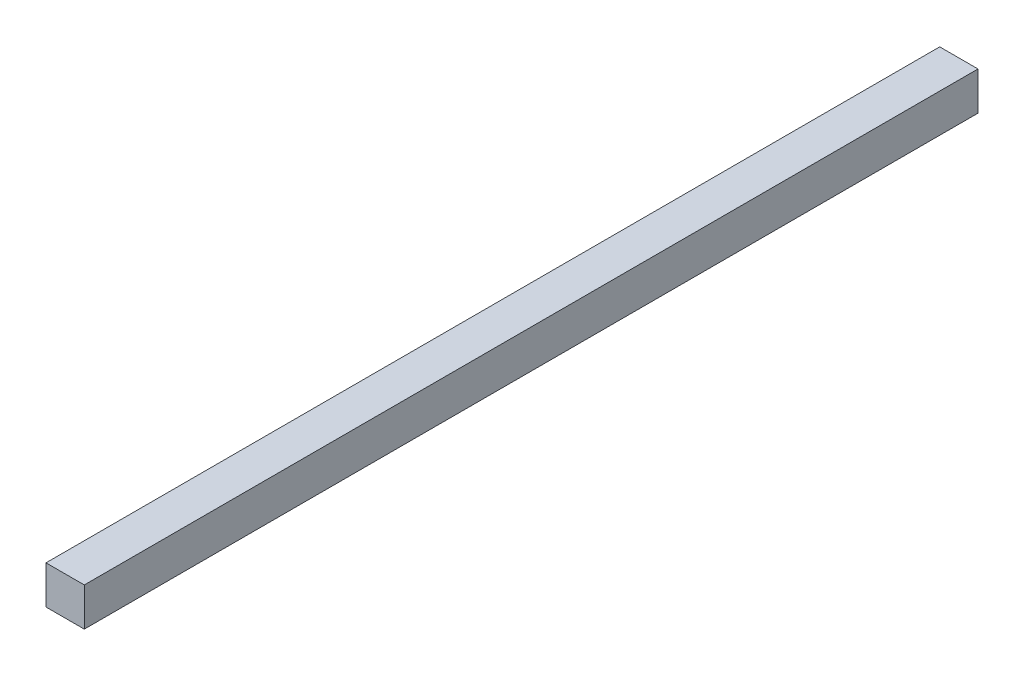
ISO-10303-21;
HEADER;
FILE_DESCRIPTION(('STEP AP214'),'2;1');
FILE_NAME('part.step','',(''),(''),'','','');
FILE_SCHEMA(('AUTOMOTIVE_DESIGN { 1 0 10303 214 1 1 1 1 }'));
ENDSEC;
DATA;
#1=APPLICATION_CONTEXT('core data for automotive mechanical design processes');
#2=APPLICATION_PROTOCOL_DEFINITION('international standard','automotive_design',2000,#1);
#3=PRODUCT_CONTEXT('',#1,'mechanical');
#4=PRODUCT('Part','Part','',(#3));
#5=PRODUCT_RELATED_PRODUCT_CATEGORY('part','',(#4));
#6=PRODUCT_DEFINITION_FORMATION('','',#4);
#7=PRODUCT_DEFINITION_CONTEXT('part definition',#1,'design');
#8=PRODUCT_DEFINITION('design','',#6,#7);
#9=PRODUCT_DEFINITION_SHAPE('','',#8);
#10=(LENGTH_UNIT() NAMED_UNIT(*) SI_UNIT(.MILLI.,.METRE.));
#11=(NAMED_UNIT(*) PLANE_ANGLE_UNIT() SI_UNIT($,.RADIAN.));
#12=(NAMED_UNIT(*) SI_UNIT($,.STERADIAN.) SOLID_ANGLE_UNIT());
#13=UNCERTAINTY_MEASURE_WITH_UNIT(LENGTH_MEASURE(1.E-05),#10,'distance_accuracy_value','');
#14=(GEOMETRIC_REPRESENTATION_CONTEXT(3) GLOBAL_UNCERTAINTY_ASSIGNED_CONTEXT((#13)) GLOBAL_UNIT_ASSIGNED_CONTEXT((#10,
#11,#12)) REPRESENTATION_CONTEXT('',''));
#15=CARTESIAN_POINT('',(0.,0.,0.));
#16=DIRECTION('',(0.,0.,1.));
#17=DIRECTION('',(1.,0.,0.));
#18=AXIS2_PLACEMENT_3D('',#15,#16,#17);
#19=CARTESIAN_POINT('',(15.,-15.,700.));
#20=DIRECTION('',(-1.,0.,0.));
#21=DIRECTION('',(0.,0.,1.));
#22=AXIS2_PLACEMENT_3D('',#19,#20,#21);
#23=PLANE('',#22);
#24=DIRECTION('',(0.,1.,0.));
#25=VECTOR('',#24,1.);
#26=CARTESIAN_POINT('',(15.,-15.,0.));
#27=LINE('',#26,#25);
#28=CARTESIAN_POINT('',(15.,-15.,0.));
#29=VERTEX_POINT('',#28);
#30=CARTESIAN_POINT('',(15.,15.,0.));
#31=VERTEX_POINT('',#30);
#32=EDGE_CURVE('E107',#29,#31,#27,.T.);
#33=ORIENTED_EDGE('',*,*,#32,.T.);
#34=DIRECTION('',(0.,0.,-1.));
#35=VECTOR('',#34,1.);
#36=CARTESIAN_POINT('',(15.,15.,700.));
#37=LINE('',#36,#35);
#38=CARTESIAN_POINT('',(15.,15.,700.));
#39=VERTEX_POINT('',#38);
#40=EDGE_CURVE('E11',#39,#31,#37,.T.);
#41=ORIENTED_EDGE('',*,*,#40,.F.);
#42=DIRECTION('',(0.,1.,0.));
#43=VECTOR('',#42,1.);
#44=CARTESIAN_POINT('',(15.,-15.,700.));
#45=LINE('',#44,#43);
#46=CARTESIAN_POINT('',(15.,-15.,700.));
#47=VERTEX_POINT('',#46);
#48=EDGE_CURVE('E91',#47,#39,#45,.T.);
#49=ORIENTED_EDGE('',*,*,#48,.F.);
#50=DIRECTION('',(0.,0.,-1.));
#51=VECTOR('',#50,1.);
#52=CARTESIAN_POINT('',(15.,-15.,700.));
#53=LINE('',#52,#51);
#54=EDGE_CURVE('E103',#47,#29,#53,.T.);
#55=ORIENTED_EDGE('',*,*,#54,.T.);
#56=EDGE_LOOP('',(#33,#41,#49,#55));
#57=FACE_BOUND('',#56,.T.);
#58=ADVANCED_FACE('F39',(#57),#23,.F.);
#59=CARTESIAN_POINT('',(-15.,15.,700.));
#60=DIRECTION('',(0.,-1.,0.));
#61=DIRECTION('',(0.,0.,-1.));
#62=AXIS2_PLACEMENT_3D('',#59,#60,#61);
#63=PLANE('',#62);
#64=DIRECTION('',(-1.,0.,0.));
#65=VECTOR('',#64,1.);
#66=CARTESIAN_POINT('',(-15.,15.,0.));
#67=LINE('',#66,#65);
#68=CARTESIAN_POINT('',(-15.,15.,0.));
#69=VERTEX_POINT('',#68);
#70=EDGE_CURVE('E96',#31,#69,#67,.T.);
#71=ORIENTED_EDGE('',*,*,#70,.T.);
#72=DIRECTION('',(0.,0.,-1.));
#73=VECTOR('',#72,1.);
#74=CARTESIAN_POINT('',(-15.,15.,700.));
#75=LINE('',#74,#73);
#76=CARTESIAN_POINT('',(-15.,15.,700.));
#77=VERTEX_POINT('',#76);
#78=EDGE_CURVE('E48',#77,#69,#75,.T.);
#79=ORIENTED_EDGE('',*,*,#78,.F.);
#80=DIRECTION('',(-1.,0.,0.));
#81=VECTOR('',#80,1.);
#82=CARTESIAN_POINT('',(-15.,15.,700.));
#83=LINE('',#82,#81);
#84=EDGE_CURVE('E86',#39,#77,#83,.T.);
#85=ORIENTED_EDGE('',*,*,#84,.F.);
#86=ORIENTED_EDGE('',*,*,#40,.T.);
#87=EDGE_LOOP('',(#71,#79,#85,#86));
#88=FACE_BOUND('',#87,.T.);
#89=ADVANCED_FACE('F95',(#88),#63,.F.);
#90=CARTESIAN_POINT('',(-15.,-15.,700.));
#91=DIRECTION('',(1.,0.,0.));
#92=DIRECTION('',(0.,0.,-1.));
#93=AXIS2_PLACEMENT_3D('',#90,#91,#92);
#94=PLANE('',#93);
#95=DIRECTION('',(0.,-1.,0.));
#96=VECTOR('',#95,1.);
#97=CARTESIAN_POINT('',(-15.,-15.,0.));
#98=LINE('',#97,#96);
#99=CARTESIAN_POINT('',(-15.,-15.,0.));
#100=VERTEX_POINT('',#99);
#101=EDGE_CURVE('E73',#69,#100,#98,.T.);
#102=ORIENTED_EDGE('',*,*,#101,.T.);
#103=DIRECTION('',(0.,0.,-1.));
#104=VECTOR('',#103,1.);
#105=CARTESIAN_POINT('',(-15.,-15.,700.));
#106=LINE('',#105,#104);
#107=CARTESIAN_POINT('',(-15.,-15.,700.));
#108=VERTEX_POINT('',#107);
#109=EDGE_CURVE('E98',#108,#100,#106,.T.);
#110=ORIENTED_EDGE('',*,*,#109,.F.);
#111=DIRECTION('',(0.,-1.,0.));
#112=VECTOR('',#111,1.);
#113=CARTESIAN_POINT('',(-15.,-15.,700.));
#114=LINE('',#113,#112);
#115=EDGE_CURVE('E89',#77,#108,#114,.T.);
#116=ORIENTED_EDGE('',*,*,#115,.F.);
#117=ORIENTED_EDGE('',*,*,#78,.T.);
#118=EDGE_LOOP('',(#102,#110,#116,#117));
#119=FACE_BOUND('',#118,.T.);
#120=ADVANCED_FACE('F99',(#119),#94,.F.);
#121=CARTESIAN_POINT('',(-15.,-15.,700.));
#122=DIRECTION('',(0.,1.,0.));
#123=DIRECTION('',(0.,0.,1.));
#124=AXIS2_PLACEMENT_3D('',#121,#122,#123);
#125=PLANE('',#124);
#126=DIRECTION('',(1.,0.,0.));
#127=VECTOR('',#126,1.);
#128=CARTESIAN_POINT('',(-15.,-15.,0.));
#129=LINE('',#128,#127);
#130=EDGE_CURVE('E79',#100,#29,#129,.T.);
#131=ORIENTED_EDGE('',*,*,#130,.T.);
#132=ORIENTED_EDGE('',*,*,#54,.F.);
#133=DIRECTION('',(1.,0.,0.));
#134=VECTOR('',#133,1.);
#135=CARTESIAN_POINT('',(-15.,-15.,700.));
#136=LINE('',#135,#134);
#137=EDGE_CURVE('E56',#108,#47,#136,.T.);
#138=ORIENTED_EDGE('',*,*,#137,.F.);
#139=ORIENTED_EDGE('',*,*,#109,.T.);
#140=EDGE_LOOP('',(#131,#132,#138,#139));
#141=FACE_BOUND('',#140,.T.);
#142=ADVANCED_FACE('F120',(#141),#125,.F.);
#143=CARTESIAN_POINT('',(0.,0.,700.));
#144=DIRECTION('',(0.,0.,-1.));
#145=DIRECTION('',(-1.,0.,0.));
#146=AXIS2_PLACEMENT_3D('',#143,#144,#145);
#147=PLANE('',#146);
#148=ORIENTED_EDGE('',*,*,#48,.T.);
#149=ORIENTED_EDGE('',*,*,#84,.T.);
#150=ORIENTED_EDGE('',*,*,#115,.T.);
#151=ORIENTED_EDGE('',*,*,#137,.T.);
#152=EDGE_LOOP('',(#148,#149,#150,#151));
#153=FACE_BOUND('',#152,.T.);
#154=ADVANCED_FACE('F87',(#153),#147,.F.);
#155=CARTESIAN_POINT('',(0.,0.,0.));
#156=DIRECTION('',(0.,0.,-1.));
#157=DIRECTION('',(-1.,0.,0.));
#158=AXIS2_PLACEMENT_3D('',#155,#156,#157);
#159=PLANE('',#158);
#160=ORIENTED_EDGE('',*,*,#32,.F.);
#161=ORIENTED_EDGE('',*,*,#130,.F.);
#162=ORIENTED_EDGE('',*,*,#101,.F.);
#163=ORIENTED_EDGE('',*,*,#70,.F.);
#164=EDGE_LOOP('',(#160,#161,#162,#163));
#165=FACE_BOUND('',#164,.T.);
#166=ADVANCED_FACE('F123',(#165),#159,.T.);
#167=CLOSED_SHELL('',(#58,#89,#120,#142,#154,#166));
#168=MANIFOLD_SOLID_BREP('B2',#167);
#169=ADVANCED_BREP_SHAPE_REPRESENTATION('',(#18,#168),#14);
#170=SHAPE_DEFINITION_REPRESENTATION(#9,#169);
ENDSEC;
END-ISO-10303-21;
